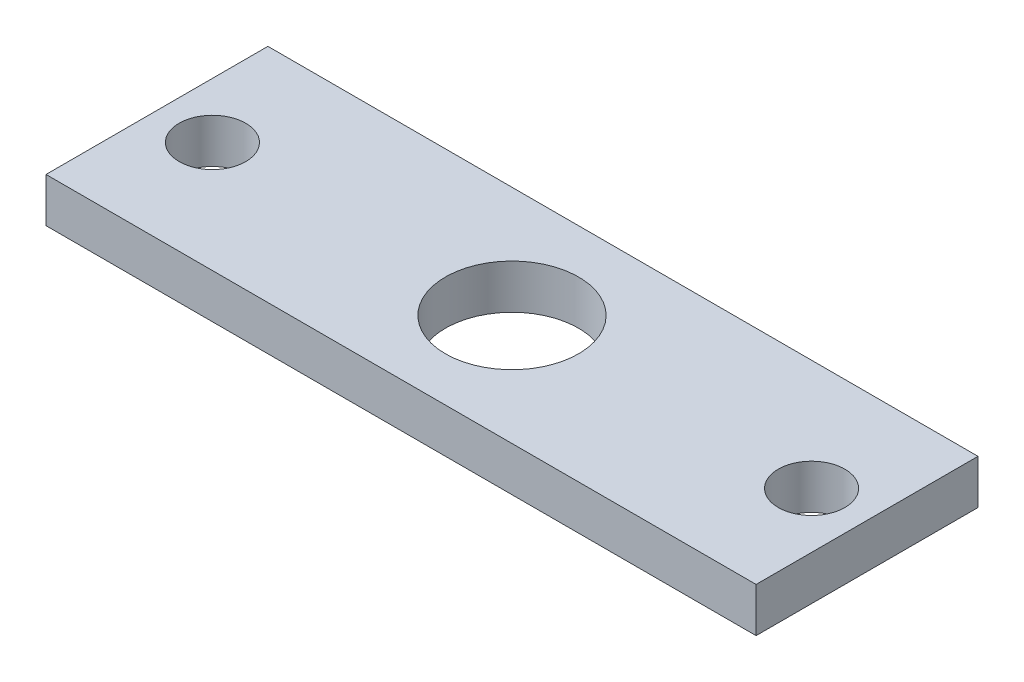
ISO-10303-21;
HEADER;
FILE_DESCRIPTION(('STEP AP214'),'2;1');
FILE_NAME('part.step','',(''),(''),'','','');
FILE_SCHEMA(('AUTOMOTIVE_DESIGN { 1 0 10303 214 1 1 1 1 }'));
ENDSEC;
DATA;
#1=APPLICATION_CONTEXT('core data for automotive mechanical design processes');
#2=APPLICATION_PROTOCOL_DEFINITION('international standard','automotive_design',2000,#1);
#3=PRODUCT_CONTEXT('',#1,'mechanical');
#4=PRODUCT('Part','Part','',(#3));
#5=PRODUCT_RELATED_PRODUCT_CATEGORY('part','',(#4));
#6=PRODUCT_DEFINITION_FORMATION('','',#4);
#7=PRODUCT_DEFINITION_CONTEXT('part definition',#1,'design');
#8=PRODUCT_DEFINITION('design','',#6,#7);
#9=PRODUCT_DEFINITION_SHAPE('','',#8);
#10=(LENGTH_UNIT() NAMED_UNIT(*) SI_UNIT(.MILLI.,.METRE.));
#11=(NAMED_UNIT(*) PLANE_ANGLE_UNIT() SI_UNIT($,.RADIAN.));
#12=(NAMED_UNIT(*) SI_UNIT($,.STERADIAN.) SOLID_ANGLE_UNIT());
#13=UNCERTAINTY_MEASURE_WITH_UNIT(LENGTH_MEASURE(1.E-05),#10,'distance_accuracy_value','');
#14=(GEOMETRIC_REPRESENTATION_CONTEXT(3) GLOBAL_UNCERTAINTY_ASSIGNED_CONTEXT((#13)) GLOBAL_UNIT_ASSIGNED_CONTEXT((#10,
#11,#12)) REPRESENTATION_CONTEXT('',''));
#15=CARTESIAN_POINT('',(0.,0.,0.));
#16=DIRECTION('',(0.,0.,1.));
#17=DIRECTION('',(1.,0.,0.));
#18=AXIS2_PLACEMENT_3D('',#15,#16,#17);
#19=CARTESIAN_POINT('',(-25.3333333333333,2.,-5.13157894736842));
#20=DIRECTION('',(1.,0.,0.));
#21=DIRECTION('',(0.,0.,-1.));
#22=AXIS2_PLACEMENT_3D('',#19,#20,#21);
#23=PLANE('',#22);
#24=DIRECTION('',(0.,0.,1.));
#25=VECTOR('',#24,1.);
#26=CARTESIAN_POINT('',(-25.3333333333333,0.,-5.13157894736842));
#27=LINE('',#26,#25);
#28=CARTESIAN_POINT('',(-25.3333333333333,0.,-5.13157894736842));
#29=VERTEX_POINT('',#28);
#30=CARTESIAN_POINT('',(-25.3333333333333,0.,4.86842105263158));
#31=VERTEX_POINT('',#30);
#32=EDGE_CURVE('E107',#29,#31,#27,.T.);
#33=ORIENTED_EDGE('',*,*,#32,.T.);
#34=DIRECTION('',(0.,-1.,0.));
#35=VECTOR('',#34,1.);
#36=CARTESIAN_POINT('',(-25.3333333333333,2.,4.86842105263158));
#37=LINE('',#36,#35);
#38=CARTESIAN_POINT('',(-25.3333333333333,2.,4.86842105263158));
#39=VERTEX_POINT('',#38);
#40=EDGE_CURVE('E11',#39,#31,#37,.T.);
#41=ORIENTED_EDGE('',*,*,#40,.F.);
#42=DIRECTION('',(0.,0.,1.));
#43=VECTOR('',#42,1.);
#44=CARTESIAN_POINT('',(-25.3333333333333,2.,-5.13157894736842));
#45=LINE('',#44,#43);
#46=CARTESIAN_POINT('',(-25.3333333333333,2.,-5.13157894736842));
#47=VERTEX_POINT('',#46);
#48=EDGE_CURVE('E91',#47,#39,#45,.T.);
#49=ORIENTED_EDGE('',*,*,#48,.F.);
#50=DIRECTION('',(0.,-1.,0.));
#51=VECTOR('',#50,1.);
#52=CARTESIAN_POINT('',(-25.3333333333333,2.,-5.13157894736842));
#53=LINE('',#52,#51);
#54=EDGE_CURVE('E103',#47,#29,#53,.T.);
#55=ORIENTED_EDGE('',*,*,#54,.T.);
#56=EDGE_LOOP('',(#33,#41,#49,#55));
#57=FACE_BOUND('',#56,.T.);
#58=ADVANCED_FACE('F39',(#57),#23,.F.);
#59=CARTESIAN_POINT('',(-25.3333333333333,2.,4.86842105263158));
#60=DIRECTION('',(0.,0.,-1.));
#61=DIRECTION('',(-1.,0.,0.));
#62=AXIS2_PLACEMENT_3D('',#59,#60,#61);
#63=PLANE('',#62);
#64=DIRECTION('',(1.,0.,0.));
#65=VECTOR('',#64,1.);
#66=CARTESIAN_POINT('',(-25.3333333333333,0.,4.86842105263158));
#67=LINE('',#66,#65);
#68=CARTESIAN_POINT('',(6.66666666666668,0.,4.86842105263158));
#69=VERTEX_POINT('',#68);
#70=EDGE_CURVE('E96',#31,#69,#67,.T.);
#71=ORIENTED_EDGE('',*,*,#70,.T.);
#72=DIRECTION('',(0.,-1.,0.));
#73=VECTOR('',#72,1.);
#74=CARTESIAN_POINT('',(6.66666666666668,2.,4.86842105263158));
#75=LINE('',#74,#73);
#76=CARTESIAN_POINT('',(6.66666666666668,2.,4.86842105263158));
#77=VERTEX_POINT('',#76);
#78=EDGE_CURVE('E48',#77,#69,#75,.T.);
#79=ORIENTED_EDGE('',*,*,#78,.F.);
#80=DIRECTION('',(1.,0.,0.));
#81=VECTOR('',#80,1.);
#82=CARTESIAN_POINT('',(-25.3333333333333,2.,4.86842105263158));
#83=LINE('',#82,#81);
#84=EDGE_CURVE('E86',#39,#77,#83,.T.);
#85=ORIENTED_EDGE('',*,*,#84,.F.);
#86=ORIENTED_EDGE('',*,*,#40,.T.);
#87=EDGE_LOOP('',(#71,#79,#85,#86));
#88=FACE_BOUND('',#87,.T.);
#89=ADVANCED_FACE('F95',(#88),#63,.F.);
#90=CARTESIAN_POINT('',(6.66666666666668,2.,-5.13157894736842));
#91=DIRECTION('',(-1.,0.,0.));
#92=DIRECTION('',(0.,0.,1.));
#93=AXIS2_PLACEMENT_3D('',#90,#91,#92);
#94=PLANE('',#93);
#95=DIRECTION('',(0.,0.,-1.));
#96=VECTOR('',#95,1.);
#97=CARTESIAN_POINT('',(6.66666666666668,0.,-5.13157894736842));
#98=LINE('',#97,#96);
#99=CARTESIAN_POINT('',(6.66666666666668,0.,-5.13157894736842));
#100=VERTEX_POINT('',#99);
#101=EDGE_CURVE('E73',#69,#100,#98,.T.);
#102=ORIENTED_EDGE('',*,*,#101,.T.);
#103=DIRECTION('',(0.,-1.,0.));
#104=VECTOR('',#103,1.);
#105=CARTESIAN_POINT('',(6.66666666666668,2.,-5.13157894736842));
#106=LINE('',#105,#104);
#107=CARTESIAN_POINT('',(6.66666666666668,2.,-5.13157894736842));
#108=VERTEX_POINT('',#107);
#109=EDGE_CURVE('E98',#108,#100,#106,.T.);
#110=ORIENTED_EDGE('',*,*,#109,.F.);
#111=DIRECTION('',(0.,0.,-1.));
#112=VECTOR('',#111,1.);
#113=CARTESIAN_POINT('',(6.66666666666668,2.,-5.13157894736842));
#114=LINE('',#113,#112);
#115=EDGE_CURVE('E89',#77,#108,#114,.T.);
#116=ORIENTED_EDGE('',*,*,#115,.F.);
#117=ORIENTED_EDGE('',*,*,#78,.T.);
#118=EDGE_LOOP('',(#102,#110,#116,#117));
#119=FACE_BOUND('',#118,.T.);
#120=ADVANCED_FACE('F99',(#119),#94,.F.);
#121=CARTESIAN_POINT('',(-25.3333333333333,2.,-5.13157894736842));
#122=DIRECTION('',(0.,0.,1.));
#123=DIRECTION('',(1.,0.,0.));
#124=AXIS2_PLACEMENT_3D('',#121,#122,#123);
#125=PLANE('',#124);
#126=DIRECTION('',(-1.,0.,0.));
#127=VECTOR('',#126,1.);
#128=CARTESIAN_POINT('',(-25.3333333333333,0.,-5.13157894736842));
#129=LINE('',#128,#127);
#130=EDGE_CURVE('E79',#100,#29,#129,.T.);
#131=ORIENTED_EDGE('',*,*,#130,.T.);
#132=ORIENTED_EDGE('',*,*,#54,.F.);
#133=DIRECTION('',(-1.,0.,0.));
#134=VECTOR('',#133,1.);
#135=CARTESIAN_POINT('',(-25.3333333333333,2.,-5.13157894736842));
#136=LINE('',#135,#134);
#137=EDGE_CURVE('E56',#108,#47,#136,.T.);
#138=ORIENTED_EDGE('',*,*,#137,.F.);
#139=ORIENTED_EDGE('',*,*,#109,.T.);
#140=EDGE_LOOP('',(#131,#132,#138,#139));
#141=FACE_BOUND('',#140,.T.);
#142=ADVANCED_FACE('F121',(#141),#125,.F.);
#143=CARTESIAN_POINT('',(0.,2.,0.));
#144=DIRECTION('',(0.,1.,0.));
#145=DIRECTION('',(0.,0.,1.));
#146=AXIS2_PLACEMENT_3D('',#143,#144,#145);
#147=PLANE('',#146);
#148=CARTESIAN_POINT('',(-22.8333333333333,2.,-0.131578947368416));
#149=DIRECTION('',(0.,1.,0.));
#150=DIRECTION('',(0.,0.,1.));
#151=AXIS2_PLACEMENT_3D('',#148,#149,#150);
#152=CIRCLE('',#151,1.5);
#153=CARTESIAN_POINT('',(-22.8333333333333,2.,1.36842105263158));
#154=VERTEX_POINT('',#153);
#155=EDGE_CURVE('E144',#154,#154,#152,.T.);
#156=ORIENTED_EDGE('',*,*,#155,.F.);
#157=EDGE_LOOP('',(#156));
#158=FACE_BOUND('',#157,.T.);
#159=CARTESIAN_POINT('',(4.16666666666668,2.,-0.131578947368416));
#160=DIRECTION('',(0.,1.,0.));
#161=DIRECTION('',(0.,0.,1.));
#162=AXIS2_PLACEMENT_3D('',#159,#160,#161);
#163=CIRCLE('',#162,1.5);
#164=CARTESIAN_POINT('',(4.16666666666668,2.,1.36842105263158));
#165=VERTEX_POINT('',#164);
#166=EDGE_CURVE('E136',#165,#165,#163,.T.);
#167=ORIENTED_EDGE('',*,*,#166,.F.);
#168=EDGE_LOOP('',(#167));
#169=FACE_BOUND('',#168,.T.);
#170=CARTESIAN_POINT('',(-9.33333333333332,2.,-0.131578947368416));
#171=DIRECTION('',(0.,1.,0.));
#172=DIRECTION('',(0.,0.,1.));
#173=AXIS2_PLACEMENT_3D('',#170,#171,#172);
#174=CIRCLE('',#173,3.);
#175=CARTESIAN_POINT('',(-9.33333333333332,2.,2.86842105263158));
#176=VERTEX_POINT('',#175);
#177=EDGE_CURVE('E128',#176,#176,#174,.T.);
#178=ORIENTED_EDGE('',*,*,#177,.F.);
#179=EDGE_LOOP('',(#178));
#180=FACE_BOUND('',#179,.T.);
#181=ORIENTED_EDGE('',*,*,#48,.T.);
#182=ORIENTED_EDGE('',*,*,#84,.T.);
#183=ORIENTED_EDGE('',*,*,#115,.T.);
#184=ORIENTED_EDGE('',*,*,#137,.T.);
#185=EDGE_LOOP('',(#181,#182,#183,#184));
#186=FACE_BOUND('',#185,.T.);
#187=ADVANCED_FACE('F87',(#158,#169,#180,#186),#147,.T.);
#188=CARTESIAN_POINT('',(0.,0.,0.));
#189=DIRECTION('',(0.,1.,0.));
#190=DIRECTION('',(0.,0.,1.));
#191=AXIS2_PLACEMENT_3D('',#188,#189,#190);
#192=PLANE('',#191);
#193=CARTESIAN_POINT('',(-22.8333333333333,0.,-0.131578947368416));
#194=DIRECTION('',(0.,1.,0.));
#195=DIRECTION('',(0.,0.,1.));
#196=AXIS2_PLACEMENT_3D('',#193,#194,#195);
#197=CIRCLE('',#196,1.5);
#198=CARTESIAN_POINT('',(-22.8333333333333,0.,1.36842105263158));
#199=VERTEX_POINT('',#198);
#200=EDGE_CURVE('E111',#199,#199,#197,.T.);
#201=ORIENTED_EDGE('',*,*,#200,.T.);
#202=EDGE_LOOP('',(#201));
#203=FACE_BOUND('',#202,.T.);
#204=CARTESIAN_POINT('',(4.16666666666668,0.,-0.131578947368416));
#205=DIRECTION('',(0.,1.,0.));
#206=DIRECTION('',(0.,0.,1.));
#207=AXIS2_PLACEMENT_3D('',#204,#205,#206);
#208=CIRCLE('',#207,1.5);
#209=CARTESIAN_POINT('',(4.16666666666668,0.,1.36842105263158));
#210=VERTEX_POINT('',#209);
#211=EDGE_CURVE('E140',#210,#210,#208,.T.);
#212=ORIENTED_EDGE('',*,*,#211,.T.);
#213=EDGE_LOOP('',(#212));
#214=FACE_BOUND('',#213,.T.);
#215=CARTESIAN_POINT('',(-9.33333333333332,0.,-0.131578947368416));
#216=DIRECTION('',(0.,1.,0.));
#217=DIRECTION('',(0.,0.,1.));
#218=AXIS2_PLACEMENT_3D('',#215,#216,#217);
#219=CIRCLE('',#218,3.);
#220=CARTESIAN_POINT('',(-9.33333333333332,0.,2.86842105263158));
#221=VERTEX_POINT('',#220);
#222=EDGE_CURVE('E132',#221,#221,#219,.T.);
#223=ORIENTED_EDGE('',*,*,#222,.T.);
#224=EDGE_LOOP('',(#223));
#225=FACE_BOUND('',#224,.T.);
#226=ORIENTED_EDGE('',*,*,#32,.F.);
#227=ORIENTED_EDGE('',*,*,#130,.F.);
#228=ORIENTED_EDGE('',*,*,#101,.F.);
#229=ORIENTED_EDGE('',*,*,#70,.F.);
#230=EDGE_LOOP('',(#226,#227,#228,#229));
#231=FACE_BOUND('',#230,.T.);
#232=ADVANCED_FACE('F124',(#203,#214,#225,#231),#192,.F.);
#233=CARTESIAN_POINT('',(-9.33333333333332,0.,-0.131578947368416));
#234=DIRECTION('',(0.,1.,0.));
#235=DIRECTION('',(0.,0.,1.));
#236=AXIS2_PLACEMENT_3D('',#233,#234,#235);
#237=CYLINDRICAL_SURFACE('',#236,3.);
#238=ORIENTED_EDGE('',*,*,#222,.F.);
#239=EDGE_LOOP('',(#238));
#240=FACE_BOUND('',#239,.T.);
#241=ORIENTED_EDGE('',*,*,#177,.T.);
#242=EDGE_LOOP('',(#241));
#243=FACE_BOUND('',#242,.T.);
#244=ADVANCED_FACE('F168',(#240,#243),#237,.F.);
#245=CARTESIAN_POINT('',(4.16666666666668,0.,-0.131578947368416));
#246=DIRECTION('',(0.,1.,0.));
#247=DIRECTION('',(0.,0.,1.));
#248=AXIS2_PLACEMENT_3D('',#245,#246,#247);
#249=CYLINDRICAL_SURFACE('',#248,1.5);
#250=ORIENTED_EDGE('',*,*,#211,.F.);
#251=EDGE_LOOP('',(#250));
#252=FACE_BOUND('',#251,.T.);
#253=ORIENTED_EDGE('',*,*,#166,.T.);
#254=EDGE_LOOP('',(#253));
#255=FACE_BOUND('',#254,.T.);
#256=ADVANCED_FACE('F157',(#252,#255),#249,.F.);
#257=CARTESIAN_POINT('',(-22.8333333333333,0.,-0.131578947368416));
#258=DIRECTION('',(0.,1.,0.));
#259=DIRECTION('',(0.,0.,1.));
#260=AXIS2_PLACEMENT_3D('',#257,#258,#259);
#261=CYLINDRICAL_SURFACE('',#260,1.5);
#262=ORIENTED_EDGE('',*,*,#200,.F.);
#263=EDGE_LOOP('',(#262));
#264=FACE_BOUND('',#263,.T.);
#265=ORIENTED_EDGE('',*,*,#155,.T.);
#266=EDGE_LOOP('',(#265));
#267=FACE_BOUND('',#266,.T.);
#268=ADVANCED_FACE('F154',(#264,#267),#261,.F.);
#269=CLOSED_SHELL('',(#58,#89,#120,#142,#187,#232,#244,#256,#268));
#270=MANIFOLD_SOLID_BREP('B2',#269);
#271=ADVANCED_BREP_SHAPE_REPRESENTATION('',(#18,#270),#14);
#272=SHAPE_DEFINITION_REPRESENTATION(#9,#271);
ENDSEC;
END-ISO-10303-21;
